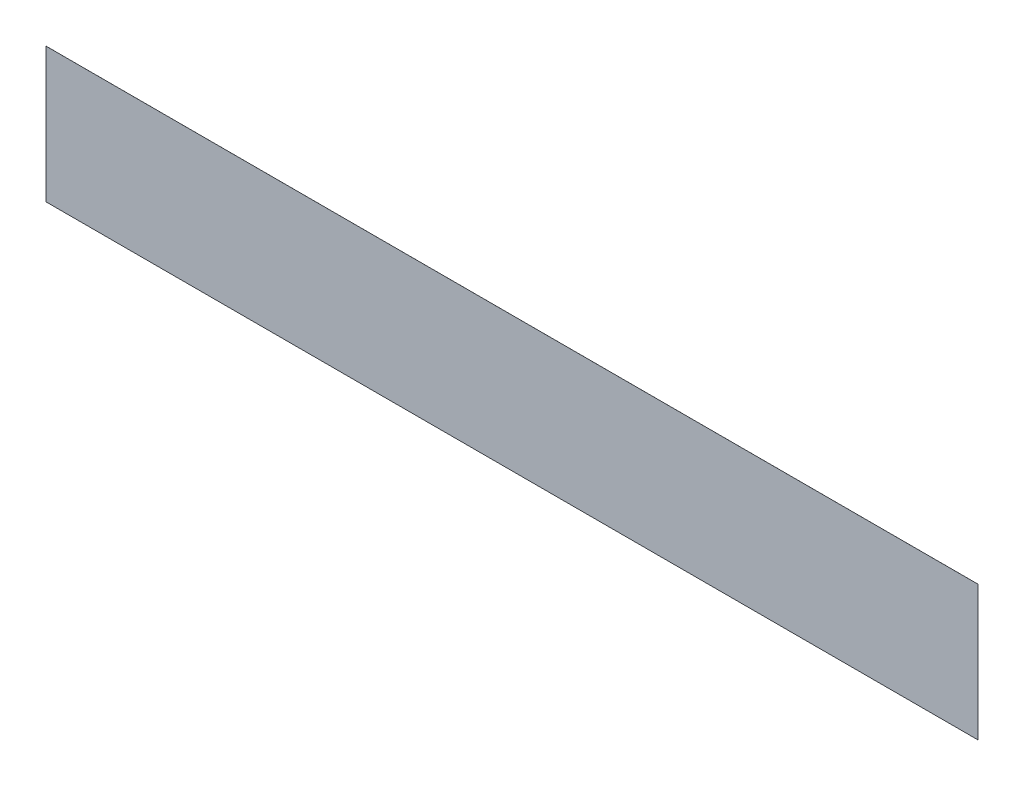
ISO-10303-21;
HEADER;
FILE_DESCRIPTION(('STEP AP214'),'2;1');
FILE_NAME('part.step','',(''),(''),'','','');
FILE_SCHEMA(('AUTOMOTIVE_DESIGN { 1 0 10303 214 1 1 1 1 }'));
ENDSEC;
DATA;
#1=APPLICATION_CONTEXT('core data for automotive mechanical design processes');
#2=APPLICATION_PROTOCOL_DEFINITION('international standard','automotive_design',2000,#1);
#3=PRODUCT_CONTEXT('',#1,'mechanical');
#4=PRODUCT('Part','Part','',(#3));
#5=PRODUCT_RELATED_PRODUCT_CATEGORY('part','',(#4));
#6=PRODUCT_DEFINITION_FORMATION('','',#4);
#7=PRODUCT_DEFINITION_CONTEXT('part definition',#1,'design');
#8=PRODUCT_DEFINITION('design','',#6,#7);
#9=PRODUCT_DEFINITION_SHAPE('','',#8);
#10=(LENGTH_UNIT() NAMED_UNIT(*) SI_UNIT(.MILLI.,.METRE.));
#11=(NAMED_UNIT(*) PLANE_ANGLE_UNIT() SI_UNIT($,.RADIAN.));
#12=(NAMED_UNIT(*) SI_UNIT($,.STERADIAN.) SOLID_ANGLE_UNIT());
#13=UNCERTAINTY_MEASURE_WITH_UNIT(LENGTH_MEASURE(1.E-05),#10,'distance_accuracy_value','');
#14=(GEOMETRIC_REPRESENTATION_CONTEXT(3) GLOBAL_UNCERTAINTY_ASSIGNED_CONTEXT((#13)) GLOBAL_UNIT_ASSIGNED_CONTEXT((#10,
#11,#12)) REPRESENTATION_CONTEXT('',''));
#15=CARTESIAN_POINT('',(0.,0.,0.));
#16=DIRECTION('',(0.,0.,1.));
#17=DIRECTION('',(1.,0.,0.));
#18=AXIS2_PLACEMENT_3D('',#15,#16,#17);
#19=CARTESIAN_POINT('',(19000.,2750.,1.));
#20=DIRECTION('',(-1.,0.,0.));
#21=DIRECTION('',(0.,-1.,0.));
#22=AXIS2_PLACEMENT_3D('',#19,#20,#21);
#23=PLANE('',#22);
#24=DIRECTION('',(0.,1.,0.));
#25=VECTOR('',#24,1.);
#26=CARTESIAN_POINT('',(19000.,2750.,0.));
#27=LINE('',#26,#25);
#28=CARTESIAN_POINT('',(19000.,-2750.,0.));
#29=VERTEX_POINT('',#28);
#30=CARTESIAN_POINT('',(19000.,2750.,0.));
#31=VERTEX_POINT('',#30);
#32=EDGE_CURVE('E102',#29,#31,#27,.T.);
#33=ORIENTED_EDGE('',*,*,#32,.T.);
#34=DIRECTION('',(0.,0.,-1.));
#35=VECTOR('',#34,1.);
#36=CARTESIAN_POINT('',(19000.,2750.,1.));
#37=LINE('',#36,#35);
#38=CARTESIAN_POINT('',(19000.,2750.,1.));
#39=VERTEX_POINT('',#38);
#40=EDGE_CURVE('E11',#39,#31,#37,.T.);
#41=ORIENTED_EDGE('',*,*,#40,.F.);
#42=DIRECTION('',(0.,1.,0.));
#43=VECTOR('',#42,1.);
#44=CARTESIAN_POINT('',(19000.,2750.,1.));
#45=LINE('',#44,#43);
#46=CARTESIAN_POINT('',(19000.,-2750.,1.));
#47=VERTEX_POINT('',#46);
#48=EDGE_CURVE('E90',#47,#39,#45,.T.);
#49=ORIENTED_EDGE('',*,*,#48,.F.);
#50=DIRECTION('',(0.,0.,-1.));
#51=VECTOR('',#50,1.);
#52=CARTESIAN_POINT('',(19000.,-2750.,1.));
#53=LINE('',#52,#51);
#54=EDGE_CURVE('E98',#47,#29,#53,.T.);
#55=ORIENTED_EDGE('',*,*,#54,.T.);
#56=EDGE_LOOP('',(#33,#41,#49,#55));
#57=FACE_BOUND('',#56,.T.);
#58=ADVANCED_FACE('F39',(#57),#23,.F.);
#59=CARTESIAN_POINT('',(-19000.,2750.,1.));
#60=DIRECTION('',(0.,-1.,0.));
#61=DIRECTION('',(0.,0.,-1.));
#62=AXIS2_PLACEMENT_3D('',#59,#60,#61);
#63=PLANE('',#62);
#64=DIRECTION('',(-1.,0.,0.));
#65=VECTOR('',#64,1.);
#66=CARTESIAN_POINT('',(-19000.,2750.,0.));
#67=LINE('',#66,#65);
#68=CARTESIAN_POINT('',(-19000.,2750.,0.));
#69=VERTEX_POINT('',#68);
#70=EDGE_CURVE('E94',#31,#69,#67,.T.);
#71=ORIENTED_EDGE('',*,*,#70,.T.);
#72=DIRECTION('',(0.,0.,-1.));
#73=VECTOR('',#72,1.);
#74=CARTESIAN_POINT('',(-19000.,2750.,1.));
#75=LINE('',#74,#73);
#76=CARTESIAN_POINT('',(-19000.,2750.,1.));
#77=VERTEX_POINT('',#76);
#78=EDGE_CURVE('E47',#77,#69,#75,.T.);
#79=ORIENTED_EDGE('',*,*,#78,.F.);
#80=DIRECTION('',(-1.,0.,0.));
#81=VECTOR('',#80,1.);
#82=CARTESIAN_POINT('',(-19000.,2750.,1.));
#83=LINE('',#82,#81);
#84=EDGE_CURVE('E85',#39,#77,#83,.T.);
#85=ORIENTED_EDGE('',*,*,#84,.F.);
#86=ORIENTED_EDGE('',*,*,#40,.T.);
#87=EDGE_LOOP('',(#71,#79,#85,#86));
#88=FACE_BOUND('',#87,.T.);
#89=ADVANCED_FACE('F93',(#88),#63,.F.);
#90=CARTESIAN_POINT('',(-19000.,2750.,1.));
#91=DIRECTION('',(1.,0.,0.));
#92=DIRECTION('',(0.,1.,0.));
#93=AXIS2_PLACEMENT_3D('',#90,#91,#92);
#94=PLANE('',#93);
#95=DIRECTION('',(0.,-1.,0.));
#96=VECTOR('',#95,1.);
#97=CARTESIAN_POINT('',(-19000.,2750.,0.));
#98=LINE('',#97,#96);
#99=CARTESIAN_POINT('',(-19000.,-2750.,0.));
#100=VERTEX_POINT('',#99);
#101=EDGE_CURVE('E72',#69,#100,#98,.T.);
#102=ORIENTED_EDGE('',*,*,#101,.T.);
#103=DIRECTION('',(0.,0.,-1.));
#104=VECTOR('',#103,1.);
#105=CARTESIAN_POINT('',(-19000.,-2750.,1.));
#106=LINE('',#105,#104);
#107=CARTESIAN_POINT('',(-19000.,-2750.,1.));
#108=VERTEX_POINT('',#107);
#109=EDGE_CURVE('E95',#108,#100,#106,.T.);
#110=ORIENTED_EDGE('',*,*,#109,.F.);
#111=DIRECTION('',(0.,-1.,0.));
#112=VECTOR('',#111,1.);
#113=CARTESIAN_POINT('',(-19000.,2750.,1.));
#114=LINE('',#113,#112);
#115=EDGE_CURVE('E88',#77,#108,#114,.T.);
#116=ORIENTED_EDGE('',*,*,#115,.F.);
#117=ORIENTED_EDGE('',*,*,#78,.T.);
#118=EDGE_LOOP('',(#102,#110,#116,#117));
#119=FACE_BOUND('',#118,.T.);
#120=ADVANCED_FACE('F96',(#119),#94,.F.);
#121=CARTESIAN_POINT('',(-19000.,-2750.,1.));
#122=DIRECTION('',(0.,1.,0.));
#123=DIRECTION('',(0.,0.,1.));
#124=AXIS2_PLACEMENT_3D('',#121,#122,#123);
#125=PLANE('',#124);
#126=DIRECTION('',(1.,0.,0.));
#127=VECTOR('',#126,1.);
#128=CARTESIAN_POINT('',(-19000.,-2750.,0.));
#129=LINE('',#128,#127);
#130=EDGE_CURVE('E78',#100,#29,#129,.T.);
#131=ORIENTED_EDGE('',*,*,#130,.T.);
#132=ORIENTED_EDGE('',*,*,#54,.F.);
#133=DIRECTION('',(1.,0.,0.));
#134=VECTOR('',#133,1.);
#135=CARTESIAN_POINT('',(-19000.,-2750.,1.));
#136=LINE('',#135,#134);
#137=EDGE_CURVE('E55',#108,#47,#136,.T.);
#138=ORIENTED_EDGE('',*,*,#137,.F.);
#139=ORIENTED_EDGE('',*,*,#109,.T.);
#140=EDGE_LOOP('',(#131,#132,#138,#139));
#141=FACE_BOUND('',#140,.T.);
#142=ADVANCED_FACE('F109',(#141),#125,.F.);
#143=CARTESIAN_POINT('',(0.,0.,1.));
#144=DIRECTION('',(0.,0.,1.));
#145=DIRECTION('',(1.,0.,0.));
#146=AXIS2_PLACEMENT_3D('',#143,#144,#145);
#147=PLANE('',#146);
#148=ORIENTED_EDGE('',*,*,#48,.T.);
#149=ORIENTED_EDGE('',*,*,#84,.T.);
#150=ORIENTED_EDGE('',*,*,#115,.T.);
#151=ORIENTED_EDGE('',*,*,#137,.T.);
#152=EDGE_LOOP('',(#148,#149,#150,#151));
#153=FACE_BOUND('',#152,.T.);
#154=ADVANCED_FACE('F86',(#153),#147,.T.);
#155=CARTESIAN_POINT('',(0.,0.,0.));
#156=DIRECTION('',(0.,0.,1.));
#157=DIRECTION('',(1.,0.,0.));
#158=AXIS2_PLACEMENT_3D('',#155,#156,#157);
#159=PLANE('',#158);
#160=ORIENTED_EDGE('',*,*,#32,.F.);
#161=ORIENTED_EDGE('',*,*,#130,.F.);
#162=ORIENTED_EDGE('',*,*,#101,.F.);
#163=ORIENTED_EDGE('',*,*,#70,.F.);
#164=EDGE_LOOP('',(#160,#161,#162,#163));
#165=FACE_BOUND('',#164,.T.);
#166=ADVANCED_FACE('F112',(#165),#159,.F.);
#167=CLOSED_SHELL('',(#58,#89,#120,#142,#154,#166));
#168=MANIFOLD_SOLID_BREP('B2',#167);
#169=ADVANCED_BREP_SHAPE_REPRESENTATION('',(#18,#168),#14);
#170=SHAPE_DEFINITION_REPRESENTATION(#9,#169);
ENDSEC;
END-ISO-10303-21;
